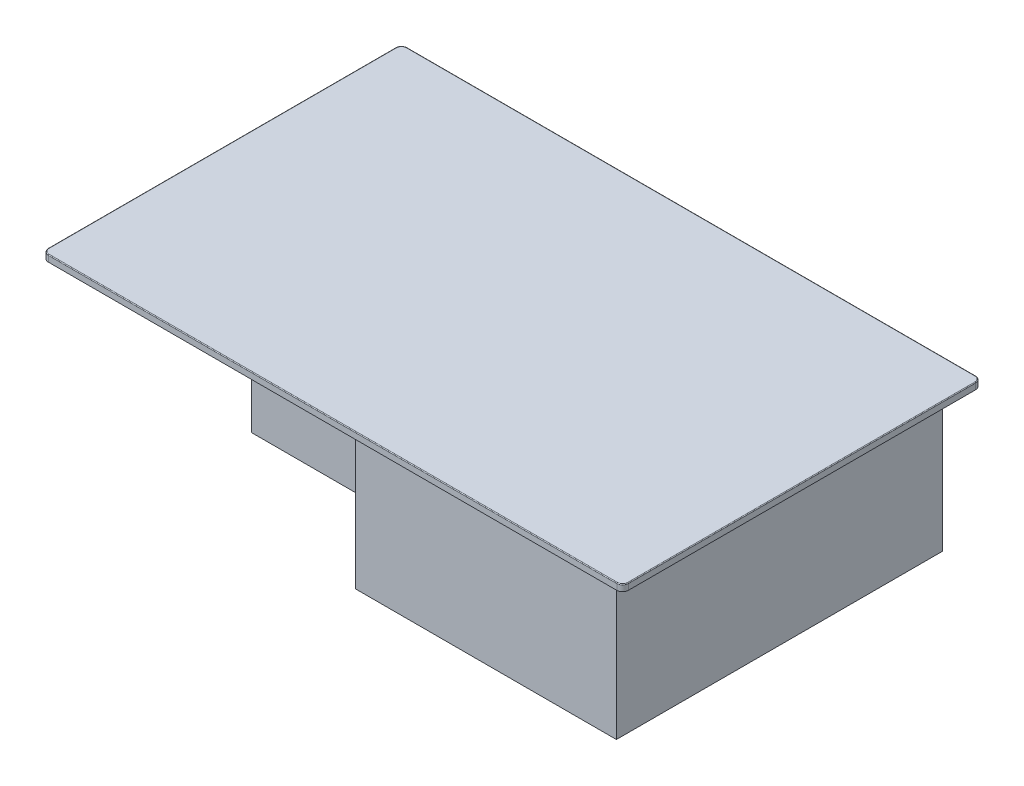
ISO-10303-21;
HEADER;
FILE_DESCRIPTION(('STEP AP214'),'2;1');
FILE_NAME('part.step','',(''),(''),'','','');
FILE_SCHEMA(('AUTOMOTIVE_DESIGN { 1 0 10303 214 1 1 1 1 }'));
ENDSEC;
DATA;
#1=APPLICATION_CONTEXT('core data for automotive mechanical design processes');
#2=APPLICATION_PROTOCOL_DEFINITION('international standard','automotive_design',2000,#1);
#3=PRODUCT_CONTEXT('',#1,'mechanical');
#4=PRODUCT('Part','Part','',(#3));
#5=PRODUCT_RELATED_PRODUCT_CATEGORY('part','',(#4));
#6=PRODUCT_DEFINITION_FORMATION('','',#4);
#7=PRODUCT_DEFINITION_CONTEXT('part definition',#1,'design');
#8=PRODUCT_DEFINITION('design','',#6,#7);
#9=PRODUCT_DEFINITION_SHAPE('','',#8);
#10=(LENGTH_UNIT() NAMED_UNIT(*) SI_UNIT(.MILLI.,.METRE.));
#11=(NAMED_UNIT(*) PLANE_ANGLE_UNIT() SI_UNIT($,.RADIAN.));
#12=(NAMED_UNIT(*) SI_UNIT($,.STERADIAN.) SOLID_ANGLE_UNIT());
#13=UNCERTAINTY_MEASURE_WITH_UNIT(LENGTH_MEASURE(1.E-05),#10,'distance_accuracy_value','');
#14=(GEOMETRIC_REPRESENTATION_CONTEXT(3) GLOBAL_UNCERTAINTY_ASSIGNED_CONTEXT((#13)) GLOBAL_UNIT_ASSIGNED_CONTEXT((#10,
#11,#12)) REPRESENTATION_CONTEXT('',''));
#15=CARTESIAN_POINT('',(0.,0.,0.));
#16=DIRECTION('',(0.,0.,1.));
#17=DIRECTION('',(1.,0.,0.));
#18=AXIS2_PLACEMENT_3D('',#15,#16,#17);
#19=CARTESIAN_POINT('',(0.,-9.,0.));
#20=DIRECTION('',(0.,1.,0.));
#21=DIRECTION('',(0.,0.,1.));
#22=AXIS2_PLACEMENT_3D('',#19,#20,#21);
#23=PLANE('',#22);
#24=DIRECTION('',(-1.,0.,0.));
#25=VECTOR('',#24,1.);
#26=CARTESIAN_POINT('',(400.,-9.,-247.5));
#27=LINE('',#26,#25);
#28=CARTESIAN_POINT('',(392.,-9.,-247.5));
#29=VERTEX_POINT('',#28);
#30=CARTESIAN_POINT('',(-392.,-9.,-247.5));
#31=VERTEX_POINT('',#30);
#32=EDGE_CURVE('E294',#29,#31,#27,.T.);
#33=ORIENTED_EDGE('',*,*,#32,.F.);
#34=CARTESIAN_POINT('',(392.,-9.,-239.5));
#35=DIRECTION('',(0.,1.,0.));
#36=DIRECTION('',(0.,0.,1.));
#37=AXIS2_PLACEMENT_3D('',#34,#35,#36);
#38=CIRCLE('',#37,8.);
#39=CARTESIAN_POINT('',(400.,-9.,-239.5));
#40=VERTEX_POINT('',#39);
#41=EDGE_CURVE('E313',#29,#40,#38,.F.);
#42=ORIENTED_EDGE('',*,*,#41,.T.);
#43=DIRECTION('',(0.,0.,-1.));
#44=VECTOR('',#43,1.);
#45=CARTESIAN_POINT('',(400.,-9.,247.5));
#46=LINE('',#45,#44);
#47=CARTESIAN_POINT('',(400.,-9.,239.5));
#48=VERTEX_POINT('',#47);
#49=EDGE_CURVE('E291',#48,#40,#46,.T.);
#50=ORIENTED_EDGE('',*,*,#49,.F.);
#51=CARTESIAN_POINT('',(392.,-9.,239.5));
#52=DIRECTION('',(0.,1.,0.));
#53=DIRECTION('',(0.,0.,1.));
#54=AXIS2_PLACEMENT_3D('',#51,#52,#53);
#55=CIRCLE('',#54,8.);
#56=CARTESIAN_POINT('',(392.,-9.,247.5));
#57=VERTEX_POINT('',#56);
#58=EDGE_CURVE('E307',#48,#57,#55,.F.);
#59=ORIENTED_EDGE('',*,*,#58,.T.);
#60=DIRECTION('',(1.,0.,0.));
#61=VECTOR('',#60,1.);
#62=CARTESIAN_POINT('',(400.,-9.,247.5));
#63=LINE('',#62,#61);
#64=CARTESIAN_POINT('',(-392.,-9.,247.5));
#65=VERTEX_POINT('',#64);
#66=EDGE_CURVE('E287',#65,#57,#63,.T.);
#67=ORIENTED_EDGE('',*,*,#66,.F.);
#68=CARTESIAN_POINT('',(-392.,-9.,239.5));
#69=DIRECTION('',(0.,1.,0.));
#70=DIRECTION('',(0.,0.,1.));
#71=AXIS2_PLACEMENT_3D('',#68,#69,#70);
#72=CIRCLE('',#71,8.);
#73=CARTESIAN_POINT('',(-400.,-9.,239.5));
#74=VERTEX_POINT('',#73);
#75=EDGE_CURVE('E309',#65,#74,#72,.F.);
#76=ORIENTED_EDGE('',*,*,#75,.T.);
#77=DIRECTION('',(0.,0.,1.));
#78=VECTOR('',#77,1.);
#79=CARTESIAN_POINT('',(-400.,-9.,247.5));
#80=LINE('',#79,#78);
#81=CARTESIAN_POINT('',(-400.,-9.,-239.5));
#82=VERTEX_POINT('',#81);
#83=EDGE_CURVE('E284',#82,#74,#80,.T.);
#84=ORIENTED_EDGE('',*,*,#83,.F.);
#85=CARTESIAN_POINT('',(-392.,-9.,-239.5));
#86=DIRECTION('',(0.,1.,0.));
#87=DIRECTION('',(0.,0.,1.));
#88=AXIS2_PLACEMENT_3D('',#85,#86,#87);
#89=CIRCLE('',#88,8.);
#90=EDGE_CURVE('E311',#82,#31,#89,.F.);
#91=ORIENTED_EDGE('',*,*,#90,.T.);
#92=EDGE_LOOP('',(#33,#42,#50,#59,#67,#76,#84,#91));
#93=FACE_BOUND('',#92,.T.);
#94=DIRECTION('',(0.,0.,-1.));
#95=VECTOR('',#94,1.);
#96=CARTESIAN_POINT('',(-387.5,-9.,-236.));
#97=LINE('',#96,#95);
#98=CARTESIAN_POINT('',(-387.5,-9.,236.));
#99=VERTEX_POINT('',#98);
#100=CARTESIAN_POINT('',(-387.5,-9.,-236.));
#101=VERTEX_POINT('',#100);
#102=EDGE_CURVE('E242',#99,#101,#97,.T.);
#103=ORIENTED_EDGE('',*,*,#102,.F.);
#104=DIRECTION('',(-1.,0.,0.));
#105=VECTOR('',#104,1.);
#106=CARTESIAN_POINT('',(387.5,-9.,236.));
#107=LINE('',#106,#105);
#108=CARTESIAN_POINT('',(387.5,-9.,236.));
#109=VERTEX_POINT('',#108);
#110=EDGE_CURVE('E255',#109,#99,#107,.T.);
#111=ORIENTED_EDGE('',*,*,#110,.F.);
#112=DIRECTION('',(0.,0.,1.));
#113=VECTOR('',#112,1.);
#114=CARTESIAN_POINT('',(387.5,-9.,-236.));
#115=LINE('',#114,#113);
#116=CARTESIAN_POINT('',(387.5,-9.,-236.));
#117=VERTEX_POINT('',#116);
#118=EDGE_CURVE('E267',#117,#109,#115,.T.);
#119=ORIENTED_EDGE('',*,*,#118,.F.);
#120=DIRECTION('',(1.,0.,0.));
#121=VECTOR('',#120,1.);
#122=CARTESIAN_POINT('',(387.5,-9.,-236.));
#123=LINE('',#122,#121);
#124=EDGE_CURVE('E264',#101,#117,#123,.T.);
#125=ORIENTED_EDGE('',*,*,#124,.F.);
#126=EDGE_LOOP('',(#103,#111,#119,#125));
#127=FACE_BOUND('',#126,.T.);
#128=ADVANCED_FACE('F35',(#93,#127),#23,.F.);
#129=CARTESIAN_POINT('',(-400.,-9.,247.5));
#130=DIRECTION('',(-1.,0.,0.));
#131=DIRECTION('',(0.,0.,1.));
#132=AXIS2_PLACEMENT_3D('',#129,#130,#131);
#133=PLANE('',#132);
#134=DIRECTION('',(0.,1.,0.));
#135=VECTOR('',#134,1.);
#136=CARTESIAN_POINT('',(-400.,-9.,239.5));
#137=LINE('',#136,#135);
#138=CARTESIAN_POINT('',(-400.,-0.999999999999999,239.5));
#139=VERTEX_POINT('',#138);
#140=EDGE_CURVE('E315',#74,#139,#137,.T.);
#141=ORIENTED_EDGE('',*,*,#140,.T.);
#142=DIRECTION('',(0.,0.,1.));
#143=VECTOR('',#142,1.);
#144=CARTESIAN_POINT('',(-400.,-0.999999999999999,247.5));
#145=LINE('',#144,#143);
#146=CARTESIAN_POINT('',(-400.,-0.999999999999999,-239.5));
#147=VERTEX_POINT('',#146);
#148=EDGE_CURVE('E349',#139,#147,#145,.F.);
#149=ORIENTED_EDGE('',*,*,#148,.T.);
#150=DIRECTION('',(0.,1.,0.));
#151=VECTOR('',#150,1.);
#152=CARTESIAN_POINT('',(-400.,-9.,-239.5));
#153=LINE('',#152,#151);
#154=EDGE_CURVE('E318',#147,#82,#153,.F.);
#155=ORIENTED_EDGE('',*,*,#154,.T.);
#156=ORIENTED_EDGE('',*,*,#83,.T.);
#157=EDGE_LOOP('',(#141,#149,#155,#156));
#158=FACE_BOUND('',#157,.T.);
#159=ADVANCED_FACE('F405',(#158),#133,.T.);
#160=CARTESIAN_POINT('',(400.,-9.,-247.5));
#161=DIRECTION('',(0.,0.,-1.));
#162=DIRECTION('',(-1.,0.,0.));
#163=AXIS2_PLACEMENT_3D('',#160,#161,#162);
#164=PLANE('',#163);
#165=DIRECTION('',(0.,1.,0.));
#166=VECTOR('',#165,1.);
#167=CARTESIAN_POINT('',(-392.,-9.,-247.5));
#168=LINE('',#167,#166);
#169=CARTESIAN_POINT('',(-392.,-0.999999999999999,-247.5));
#170=VERTEX_POINT('',#169);
#171=EDGE_CURVE('E302',#31,#170,#168,.T.);
#172=ORIENTED_EDGE('',*,*,#171,.T.);
#173=DIRECTION('',(-1.,0.,0.));
#174=VECTOR('',#173,1.);
#175=CARTESIAN_POINT('',(400.,-0.999999999999999,-247.5));
#176=LINE('',#175,#174);
#177=CARTESIAN_POINT('',(392.,-0.999999999999999,-247.5));
#178=VERTEX_POINT('',#177);
#179=EDGE_CURVE('E353',#170,#178,#176,.F.);
#180=ORIENTED_EDGE('',*,*,#179,.T.);
#181=DIRECTION('',(0.,1.,0.));
#182=VECTOR('',#181,1.);
#183=CARTESIAN_POINT('',(392.,-9.,-247.5));
#184=LINE('',#183,#182);
#185=EDGE_CURVE('E305',#178,#29,#184,.F.);
#186=ORIENTED_EDGE('',*,*,#185,.T.);
#187=ORIENTED_EDGE('',*,*,#32,.T.);
#188=EDGE_LOOP('',(#172,#180,#186,#187));
#189=FACE_BOUND('',#188,.T.);
#190=ADVANCED_FACE('F411',(#189),#164,.T.);
#191=CARTESIAN_POINT('',(400.,-9.,247.5));
#192=DIRECTION('',(1.,0.,0.));
#193=DIRECTION('',(0.,0.,-1.));
#194=AXIS2_PLACEMENT_3D('',#191,#192,#193);
#195=PLANE('',#194);
#196=DIRECTION('',(0.,1.,0.));
#197=VECTOR('',#196,1.);
#198=CARTESIAN_POINT('',(400.,-9.,-239.5));
#199=LINE('',#198,#197);
#200=CARTESIAN_POINT('',(400.,-0.999999999999999,-239.5));
#201=VERTEX_POINT('',#200);
#202=EDGE_CURVE('E299',#40,#201,#199,.T.);
#203=ORIENTED_EDGE('',*,*,#202,.T.);
#204=DIRECTION('',(0.,0.,-1.));
#205=VECTOR('',#204,1.);
#206=CARTESIAN_POINT('',(400.,-0.999999999999999,247.5));
#207=LINE('',#206,#205);
#208=CARTESIAN_POINT('',(400.,-0.999999999999999,239.5));
#209=VERTEX_POINT('',#208);
#210=EDGE_CURVE('E357',#201,#209,#207,.F.);
#211=ORIENTED_EDGE('',*,*,#210,.T.);
#212=DIRECTION('',(0.,1.,0.));
#213=VECTOR('',#212,1.);
#214=CARTESIAN_POINT('',(400.,-9.,239.5));
#215=LINE('',#214,#213);
#216=EDGE_CURVE('E297',#209,#48,#215,.F.);
#217=ORIENTED_EDGE('',*,*,#216,.T.);
#218=ORIENTED_EDGE('',*,*,#49,.T.);
#219=EDGE_LOOP('',(#203,#211,#217,#218));
#220=FACE_BOUND('',#219,.T.);
#221=ADVANCED_FACE('F428',(#220),#195,.T.);
#222=CARTESIAN_POINT('',(400.,-9.,247.5));
#223=DIRECTION('',(0.,0.,1.));
#224=DIRECTION('',(1.,0.,0.));
#225=AXIS2_PLACEMENT_3D('',#222,#223,#224);
#226=PLANE('',#225);
#227=DIRECTION('',(0.,1.,0.));
#228=VECTOR('',#227,1.);
#229=CARTESIAN_POINT('',(392.,-9.,247.5));
#230=LINE('',#229,#228);
#231=CARTESIAN_POINT('',(392.,-0.999999999999999,247.5));
#232=VERTEX_POINT('',#231);
#233=EDGE_CURVE('E320',#57,#232,#230,.T.);
#234=ORIENTED_EDGE('',*,*,#233,.T.);
#235=DIRECTION('',(1.,0.,0.));
#236=VECTOR('',#235,1.);
#237=CARTESIAN_POINT('',(400.,-0.999999999999999,247.5));
#238=LINE('',#237,#236);
#239=CARTESIAN_POINT('',(-392.,-0.999999999999999,247.5));
#240=VERTEX_POINT('',#239);
#241=EDGE_CURVE('E345',#232,#240,#238,.F.);
#242=ORIENTED_EDGE('',*,*,#241,.T.);
#243=DIRECTION('',(0.,1.,0.));
#244=VECTOR('',#243,1.);
#245=CARTESIAN_POINT('',(-392.,-9.,247.5));
#246=LINE('',#245,#244);
#247=EDGE_CURVE('E323',#240,#65,#246,.F.);
#248=ORIENTED_EDGE('',*,*,#247,.T.);
#249=ORIENTED_EDGE('',*,*,#66,.T.);
#250=EDGE_LOOP('',(#234,#242,#248,#249));
#251=FACE_BOUND('',#250,.T.);
#252=ADVANCED_FACE('F424',(#251),#226,.T.);
#253=CARTESIAN_POINT('',(0.,0.,0.));
#254=DIRECTION('',(0.,1.,0.));
#255=DIRECTION('',(0.,0.,1.));
#256=AXIS2_PLACEMENT_3D('',#253,#254,#255);
#257=PLANE('',#256);
#258=DIRECTION('',(1.,0.,0.));
#259=VECTOR('',#258,1.);
#260=CARTESIAN_POINT('',(0.,0.,246.5));
#261=LINE('',#260,#259);
#262=CARTESIAN_POINT('',(-392.,0.,246.5));
#263=VERTEX_POINT('',#262);
#264=CARTESIAN_POINT('',(392.,0.,246.5));
#265=VERTEX_POINT('',#264);
#266=EDGE_CURVE('E337',#263,#265,#261,.T.);
#267=ORIENTED_EDGE('',*,*,#266,.T.);
#268=CARTESIAN_POINT('',(392.,0.,239.5));
#269=DIRECTION('',(0.,1.,0.));
#270=DIRECTION('',(0.,0.,1.));
#271=AXIS2_PLACEMENT_3D('',#268,#269,#270);
#272=CIRCLE('',#271,7.);
#273=CARTESIAN_POINT('',(399.,0.,239.5));
#274=VERTEX_POINT('',#273);
#275=EDGE_CURVE('E339',#265,#274,#272,.T.);
#276=ORIENTED_EDGE('',*,*,#275,.T.);
#277=DIRECTION('',(0.,0.,-1.));
#278=VECTOR('',#277,1.);
#279=CARTESIAN_POINT('',(399.,0.,0.));
#280=LINE('',#279,#278);
#281=CARTESIAN_POINT('',(399.,0.,-239.5));
#282=VERTEX_POINT('',#281);
#283=EDGE_CURVE('E325',#274,#282,#280,.T.);
#284=ORIENTED_EDGE('',*,*,#283,.T.);
#285=CARTESIAN_POINT('',(392.,0.,-239.5));
#286=DIRECTION('',(0.,1.,0.));
#287=DIRECTION('',(0.,0.,1.));
#288=AXIS2_PLACEMENT_3D('',#285,#286,#287);
#289=CIRCLE('',#288,7.);
#290=CARTESIAN_POINT('',(392.,0.,-246.5));
#291=VERTEX_POINT('',#290);
#292=EDGE_CURVE('E327',#282,#291,#289,.T.);
#293=ORIENTED_EDGE('',*,*,#292,.T.);
#294=DIRECTION('',(-1.,0.,0.));
#295=VECTOR('',#294,1.);
#296=CARTESIAN_POINT('',(0.,0.,-246.5));
#297=LINE('',#296,#295);
#298=CARTESIAN_POINT('',(-392.,0.,-246.5));
#299=VERTEX_POINT('',#298);
#300=EDGE_CURVE('E329',#291,#299,#297,.T.);
#301=ORIENTED_EDGE('',*,*,#300,.T.);
#302=CARTESIAN_POINT('',(-392.,0.,-239.5));
#303=DIRECTION('',(0.,1.,0.));
#304=DIRECTION('',(0.,0.,1.));
#305=AXIS2_PLACEMENT_3D('',#302,#303,#304);
#306=CIRCLE('',#305,7.);
#307=CARTESIAN_POINT('',(-399.,0.,-239.5));
#308=VERTEX_POINT('',#307);
#309=EDGE_CURVE('E331',#299,#308,#306,.T.);
#310=ORIENTED_EDGE('',*,*,#309,.T.);
#311=DIRECTION('',(0.,0.,1.));
#312=VECTOR('',#311,1.);
#313=CARTESIAN_POINT('',(-399.,0.,0.));
#314=LINE('',#313,#312);
#315=CARTESIAN_POINT('',(-399.,0.,239.5));
#316=VERTEX_POINT('',#315);
#317=EDGE_CURVE('E333',#308,#316,#314,.T.);
#318=ORIENTED_EDGE('',*,*,#317,.T.);
#319=CARTESIAN_POINT('',(-392.,0.,239.5));
#320=DIRECTION('',(0.,1.,0.));
#321=DIRECTION('',(0.,0.,1.));
#322=AXIS2_PLACEMENT_3D('',#319,#320,#321);
#323=CIRCLE('',#322,7.);
#324=EDGE_CURVE('E335',#316,#263,#323,.T.);
#325=ORIENTED_EDGE('',*,*,#324,.T.);
#326=EDGE_LOOP('',(#267,#276,#284,#293,#301,#310,#318,#325));
#327=FACE_BOUND('',#326,.T.);
#328=ADVANCED_FACE('F420',(#327),#257,.T.);
#329=CARTESIAN_POINT('',(392.,-9.,-239.5));
#330=DIRECTION('',(0.,1.,0.));
#331=DIRECTION('',(0.,0.,1.));
#332=AXIS2_PLACEMENT_3D('',#329,#330,#331);
#333=CYLINDRICAL_SURFACE('',#332,8.);
#334=ORIENTED_EDGE('',*,*,#185,.F.);
#335=CARTESIAN_POINT('',(392.,-0.999999999999999,-239.5));
#336=DIRECTION('',(0.,1.,0.));
#337=DIRECTION('',(0.,0.,1.));
#338=AXIS2_PLACEMENT_3D('',#335,#336,#337);
#339=CIRCLE('',#338,8.);
#340=EDGE_CURVE('E355',#178,#201,#339,.F.);
#341=ORIENTED_EDGE('',*,*,#340,.T.);
#342=ORIENTED_EDGE('',*,*,#202,.F.);
#343=ORIENTED_EDGE('',*,*,#41,.F.);
#344=EDGE_LOOP('',(#334,#341,#342,#343));
#345=FACE_BOUND('',#344,.T.);
#346=ADVANCED_FACE('F423',(#345),#333,.T.);
#347=CARTESIAN_POINT('',(-392.,-9.,-239.5));
#348=DIRECTION('',(0.,1.,0.));
#349=DIRECTION('',(0.,0.,1.));
#350=AXIS2_PLACEMENT_3D('',#347,#348,#349);
#351=CYLINDRICAL_SURFACE('',#350,8.);
#352=ORIENTED_EDGE('',*,*,#154,.F.);
#353=CARTESIAN_POINT('',(-392.,-0.999999999999999,-239.5));
#354=DIRECTION('',(0.,1.,0.));
#355=DIRECTION('',(0.,0.,1.));
#356=AXIS2_PLACEMENT_3D('',#353,#354,#355);
#357=CIRCLE('',#356,8.);
#358=EDGE_CURVE('E351',#147,#170,#357,.F.);
#359=ORIENTED_EDGE('',*,*,#358,.T.);
#360=ORIENTED_EDGE('',*,*,#171,.F.);
#361=ORIENTED_EDGE('',*,*,#90,.F.);
#362=EDGE_LOOP('',(#352,#359,#360,#361));
#363=FACE_BOUND('',#362,.T.);
#364=ADVANCED_FACE('F438',(#363),#351,.T.);
#365=CARTESIAN_POINT('',(-392.,-9.,239.5));
#366=DIRECTION('',(0.,1.,0.));
#367=DIRECTION('',(0.,0.,1.));
#368=AXIS2_PLACEMENT_3D('',#365,#366,#367);
#369=CYLINDRICAL_SURFACE('',#368,8.);
#370=ORIENTED_EDGE('',*,*,#247,.F.);
#371=CARTESIAN_POINT('',(-392.,-0.999999999999999,239.5));
#372=DIRECTION('',(0.,1.,0.));
#373=DIRECTION('',(0.,0.,1.));
#374=AXIS2_PLACEMENT_3D('',#371,#372,#373);
#375=CIRCLE('',#374,8.);
#376=EDGE_CURVE('E347',#240,#139,#375,.F.);
#377=ORIENTED_EDGE('',*,*,#376,.T.);
#378=ORIENTED_EDGE('',*,*,#140,.F.);
#379=ORIENTED_EDGE('',*,*,#75,.F.);
#380=EDGE_LOOP('',(#370,#377,#378,#379));
#381=FACE_BOUND('',#380,.T.);
#382=ADVANCED_FACE('F442',(#381),#369,.T.);
#383=CARTESIAN_POINT('',(392.,-9.,239.5));
#384=DIRECTION('',(0.,1.,0.));
#385=DIRECTION('',(0.,0.,1.));
#386=AXIS2_PLACEMENT_3D('',#383,#384,#385);
#387=CYLINDRICAL_SURFACE('',#386,8.);
#388=ORIENTED_EDGE('',*,*,#216,.F.);
#389=CARTESIAN_POINT('',(392.,-0.999999999999999,239.5));
#390=DIRECTION('',(0.,1.,0.));
#391=DIRECTION('',(0.,0.,1.));
#392=AXIS2_PLACEMENT_3D('',#389,#390,#391);
#393=CIRCLE('',#392,8.);
#394=EDGE_CURVE('E342',#209,#232,#393,.F.);
#395=ORIENTED_EDGE('',*,*,#394,.T.);
#396=ORIENTED_EDGE('',*,*,#233,.F.);
#397=ORIENTED_EDGE('',*,*,#58,.F.);
#398=EDGE_LOOP('',(#388,#395,#396,#397));
#399=FACE_BOUND('',#398,.T.);
#400=ADVANCED_FACE('F446',(#399),#387,.T.);
#401=CARTESIAN_POINT('',(-392.,-0.999999999999999,-239.5));
#402=DIRECTION('',(0.,1.,0.));
#403=DIRECTION('',(0.,0.,1.));
#404=AXIS2_PLACEMENT_3D('',#401,#402,#403);
#405=TOROIDAL_SURFACE('',#404,7.,1.);
#406=CARTESIAN_POINT('',(-392.,-0.999999999999999,-246.5));
#407=DIRECTION('',(1.,0.,0.));
#408=DIRECTION('',(0.,0.,-1.));
#409=AXIS2_PLACEMENT_3D('',#406,#407,#408);
#410=CIRCLE('',#409,1.);
#411=EDGE_CURVE('E375',#170,#299,#410,.T.);
#412=ORIENTED_EDGE('',*,*,#411,.F.);
#413=ORIENTED_EDGE('',*,*,#358,.F.);
#414=CARTESIAN_POINT('',(-399.,-1.,-239.5));
#415=DIRECTION('',(0.,0.,1.));
#416=DIRECTION('',(1.,0.,0.));
#417=AXIS2_PLACEMENT_3D('',#414,#415,#416);
#418=CIRCLE('',#417,1.);
#419=EDGE_CURVE('E288',#308,#147,#418,.T.);
#420=ORIENTED_EDGE('',*,*,#419,.F.);
#421=ORIENTED_EDGE('',*,*,#309,.F.);
#422=EDGE_LOOP('',(#412,#413,#420,#421));
#423=FACE_BOUND('',#422,.T.);
#424=ADVANCED_FACE('F37',(#423),#405,.T.);
#425=CARTESIAN_POINT('',(-399.,-1.,0.));
#426=DIRECTION('',(0.,0.,1.));
#427=DIRECTION('',(1.,0.,0.));
#428=AXIS2_PLACEMENT_3D('',#425,#426,#427);
#429=CYLINDRICAL_SURFACE('',#428,1.);
#430=ORIENTED_EDGE('',*,*,#419,.T.);
#431=ORIENTED_EDGE('',*,*,#148,.F.);
#432=CARTESIAN_POINT('',(-399.,-1.,239.5));
#433=DIRECTION('',(0.,0.,1.));
#434=DIRECTION('',(1.,0.,0.));
#435=AXIS2_PLACEMENT_3D('',#432,#433,#434);
#436=CIRCLE('',#435,1.);
#437=EDGE_CURVE('E372',#316,#139,#436,.T.);
#438=ORIENTED_EDGE('',*,*,#437,.F.);
#439=ORIENTED_EDGE('',*,*,#317,.F.);
#440=EDGE_LOOP('',(#430,#431,#438,#439));
#441=FACE_BOUND('',#440,.T.);
#442=ADVANCED_FACE('F473',(#441),#429,.T.);
#443=CARTESIAN_POINT('',(0.,-1.,-246.5));
#444=DIRECTION('',(-1.,0.,0.));
#445=DIRECTION('',(0.,0.,1.));
#446=AXIS2_PLACEMENT_3D('',#443,#444,#445);
#447=CYLINDRICAL_SURFACE('',#446,1.);
#448=ORIENTED_EDGE('',*,*,#411,.T.);
#449=ORIENTED_EDGE('',*,*,#300,.F.);
#450=CARTESIAN_POINT('',(392.,-1.,-246.5));
#451=DIRECTION('',(1.,0.,0.));
#452=DIRECTION('',(0.,0.,-1.));
#453=AXIS2_PLACEMENT_3D('',#450,#451,#452);
#454=CIRCLE('',#453,1.);
#455=EDGE_CURVE('E369',#178,#291,#454,.T.);
#456=ORIENTED_EDGE('',*,*,#455,.F.);
#457=ORIENTED_EDGE('',*,*,#179,.F.);
#458=EDGE_LOOP('',(#448,#449,#456,#457));
#459=FACE_BOUND('',#458,.T.);
#460=ADVANCED_FACE('F470',(#459),#447,.T.);
#461=CARTESIAN_POINT('',(-392.,-0.999999999999999,239.5));
#462=DIRECTION('',(0.,1.,0.));
#463=DIRECTION('',(0.,0.,1.));
#464=AXIS2_PLACEMENT_3D('',#461,#462,#463);
#465=TOROIDAL_SURFACE('',#464,7.,1.);
#466=ORIENTED_EDGE('',*,*,#437,.T.);
#467=ORIENTED_EDGE('',*,*,#376,.F.);
#468=CARTESIAN_POINT('',(-392.,-1.,246.5));
#469=DIRECTION('',(1.,0.,0.));
#470=DIRECTION('',(0.,0.,-1.));
#471=AXIS2_PLACEMENT_3D('',#468,#469,#470);
#472=CIRCLE('',#471,1.);
#473=EDGE_CURVE('E366',#263,#240,#472,.T.);
#474=ORIENTED_EDGE('',*,*,#473,.F.);
#475=ORIENTED_EDGE('',*,*,#324,.F.);
#476=EDGE_LOOP('',(#466,#467,#474,#475));
#477=FACE_BOUND('',#476,.T.);
#478=ADVANCED_FACE('F466',(#477),#465,.T.);
#479=CARTESIAN_POINT('',(392.,-0.999999999999999,-239.5));
#480=DIRECTION('',(0.,1.,0.));
#481=DIRECTION('',(0.,0.,1.));
#482=AXIS2_PLACEMENT_3D('',#479,#480,#481);
#483=TOROIDAL_SURFACE('',#482,7.,1.);
#484=ORIENTED_EDGE('',*,*,#455,.T.);
#485=ORIENTED_EDGE('',*,*,#292,.F.);
#486=CARTESIAN_POINT('',(399.,-0.999999999999999,-239.5));
#487=DIRECTION('',(0.,0.,1.));
#488=DIRECTION('',(1.,0.,0.));
#489=AXIS2_PLACEMENT_3D('',#486,#487,#488);
#490=CIRCLE('',#489,1.);
#491=EDGE_CURVE('E363',#201,#282,#490,.T.);
#492=ORIENTED_EDGE('',*,*,#491,.F.);
#493=ORIENTED_EDGE('',*,*,#340,.F.);
#494=EDGE_LOOP('',(#484,#485,#492,#493));
#495=FACE_BOUND('',#494,.T.);
#496=ADVANCED_FACE('F462',(#495),#483,.T.);
#497=CARTESIAN_POINT('',(0.,-1.,246.5));
#498=DIRECTION('',(1.,0.,0.));
#499=DIRECTION('',(0.,0.,-1.));
#500=AXIS2_PLACEMENT_3D('',#497,#498,#499);
#501=CYLINDRICAL_SURFACE('',#500,1.);
#502=ORIENTED_EDGE('',*,*,#473,.T.);
#503=ORIENTED_EDGE('',*,*,#241,.F.);
#504=CARTESIAN_POINT('',(392.,-1.,246.5));
#505=DIRECTION('',(1.,0.,0.));
#506=DIRECTION('',(0.,0.,-1.));
#507=AXIS2_PLACEMENT_3D('',#504,#505,#506);
#508=CIRCLE('',#507,1.);
#509=EDGE_CURVE('E361',#265,#232,#508,.T.);
#510=ORIENTED_EDGE('',*,*,#509,.F.);
#511=ORIENTED_EDGE('',*,*,#266,.F.);
#512=EDGE_LOOP('',(#502,#503,#510,#511));
#513=FACE_BOUND('',#512,.T.);
#514=ADVANCED_FACE('F458',(#513),#501,.T.);
#515=CARTESIAN_POINT('',(399.,-1.,0.));
#516=DIRECTION('',(0.,0.,-1.));
#517=DIRECTION('',(-1.,0.,0.));
#518=AXIS2_PLACEMENT_3D('',#515,#516,#517);
#519=CYLINDRICAL_SURFACE('',#518,1.);
#520=ORIENTED_EDGE('',*,*,#491,.T.);
#521=ORIENTED_EDGE('',*,*,#283,.F.);
#522=CARTESIAN_POINT('',(399.,-1.,239.5));
#523=DIRECTION('',(0.,0.,1.));
#524=DIRECTION('',(1.,0.,0.));
#525=AXIS2_PLACEMENT_3D('',#522,#523,#524);
#526=CIRCLE('',#525,1.);
#527=EDGE_CURVE('E283',#209,#274,#526,.T.);
#528=ORIENTED_EDGE('',*,*,#527,.F.);
#529=ORIENTED_EDGE('',*,*,#210,.F.);
#530=EDGE_LOOP('',(#520,#521,#528,#529));
#531=FACE_BOUND('',#530,.T.);
#532=ADVANCED_FACE('F454',(#531),#519,.T.);
#533=CARTESIAN_POINT('',(392.,-0.999999999999999,239.5));
#534=DIRECTION('',(0.,1.,0.));
#535=DIRECTION('',(0.,0.,1.));
#536=AXIS2_PLACEMENT_3D('',#533,#534,#535);
#537=TOROIDAL_SURFACE('',#536,7.,1.);
#538=ORIENTED_EDGE('',*,*,#509,.T.);
#539=ORIENTED_EDGE('',*,*,#394,.F.);
#540=ORIENTED_EDGE('',*,*,#527,.T.);
#541=ORIENTED_EDGE('',*,*,#275,.F.);
#542=EDGE_LOOP('',(#538,#539,#540,#541));
#543=FACE_BOUND('',#542,.T.);
#544=ADVANCED_FACE('F451',(#543),#537,.T.);
#545=CARTESIAN_POINT('',(-387.5,-13.,-236.));
#546=DIRECTION('',(1.,0.,0.));
#547=DIRECTION('',(0.,0.,-1.));
#548=AXIS2_PLACEMENT_3D('',#545,#546,#547);
#549=PLANE('',#548);
#550=ORIENTED_EDGE('',*,*,#102,.T.);
#551=DIRECTION('',(0.,1.,0.));
#552=VECTOR('',#551,1.);
#553=CARTESIAN_POINT('',(-387.5,-13.,-236.));
#554=LINE('',#553,#552);
#555=CARTESIAN_POINT('',(-387.5,-13.,-236.));
#556=VERTEX_POINT('',#555);
#557=EDGE_CURVE('E280',#556,#101,#554,.T.);
#558=ORIENTED_EDGE('',*,*,#557,.F.);
#559=DIRECTION('',(0.,0.,-1.));
#560=VECTOR('',#559,1.);
#561=CARTESIAN_POINT('',(-387.5,-13.,-236.));
#562=LINE('',#561,#560);
#563=CARTESIAN_POINT('',(-387.5,-13.,236.));
#564=VERTEX_POINT('',#563);
#565=EDGE_CURVE('E251',#564,#556,#562,.T.);
#566=ORIENTED_EDGE('',*,*,#565,.F.);
#567=DIRECTION('',(0.,1.,0.));
#568=VECTOR('',#567,1.);
#569=CARTESIAN_POINT('',(-387.5,-13.,236.));
#570=LINE('',#569,#568);
#571=EDGE_CURVE('E261',#564,#99,#570,.T.);
#572=ORIENTED_EDGE('',*,*,#571,.T.);
#573=EDGE_LOOP('',(#550,#558,#566,#572));
#574=FACE_BOUND('',#573,.T.);
#575=ADVANCED_FACE('F418',(#574),#549,.F.);
#576=CARTESIAN_POINT('',(387.5,-13.,-236.));
#577=DIRECTION('',(0.,0.,1.));
#578=DIRECTION('',(1.,0.,0.));
#579=AXIS2_PLACEMENT_3D('',#576,#577,#578);
#580=PLANE('',#579);
#581=ORIENTED_EDGE('',*,*,#124,.T.);
#582=DIRECTION('',(0.,1.,0.));
#583=VECTOR('',#582,1.);
#584=CARTESIAN_POINT('',(387.5,-13.,-236.));
#585=LINE('',#584,#583);
#586=CARTESIAN_POINT('',(387.5,-13.,-236.));
#587=VERTEX_POINT('',#586);
#588=EDGE_CURVE('E277',#587,#117,#585,.T.);
#589=ORIENTED_EDGE('',*,*,#588,.F.);
#590=DIRECTION('',(1.,0.,0.));
#591=VECTOR('',#590,1.);
#592=CARTESIAN_POINT('',(387.5,-13.,-236.));
#593=LINE('',#592,#591);
#594=EDGE_CURVE('E254',#556,#587,#593,.T.);
#595=ORIENTED_EDGE('',*,*,#594,.F.);
#596=ORIENTED_EDGE('',*,*,#557,.T.);
#597=EDGE_LOOP('',(#581,#589,#595,#596));
#598=FACE_BOUND('',#597,.T.);
#599=ADVANCED_FACE('F626',(#598),#580,.F.);
#600=CARTESIAN_POINT('',(387.5,-13.,-236.));
#601=DIRECTION('',(-1.,0.,0.));
#602=DIRECTION('',(0.,0.,1.));
#603=AXIS2_PLACEMENT_3D('',#600,#601,#602);
#604=PLANE('',#603);
#605=ORIENTED_EDGE('',*,*,#118,.T.);
#606=DIRECTION('',(0.,1.,0.));
#607=VECTOR('',#606,1.);
#608=CARTESIAN_POINT('',(387.5,-13.,236.));
#609=LINE('',#608,#607);
#610=CARTESIAN_POINT('',(387.5,-13.,236.));
#611=VERTEX_POINT('',#610);
#612=EDGE_CURVE('E274',#611,#109,#609,.T.);
#613=ORIENTED_EDGE('',*,*,#612,.F.);
#614=DIRECTION('',(0.,0.,1.));
#615=VECTOR('',#614,1.);
#616=CARTESIAN_POINT('',(387.5,-13.,-236.));
#617=LINE('',#616,#615);
#618=EDGE_CURVE('E257',#587,#611,#617,.T.);
#619=ORIENTED_EDGE('',*,*,#618,.F.);
#620=ORIENTED_EDGE('',*,*,#588,.T.);
#621=EDGE_LOOP('',(#605,#613,#619,#620));
#622=FACE_BOUND('',#621,.T.);
#623=ADVANCED_FACE('F634',(#622),#604,.F.);
#624=CARTESIAN_POINT('',(387.5,-13.,236.));
#625=DIRECTION('',(0.,0.,-1.));
#626=DIRECTION('',(-1.,0.,0.));
#627=AXIS2_PLACEMENT_3D('',#624,#625,#626);
#628=PLANE('',#627);
#629=ORIENTED_EDGE('',*,*,#110,.T.);
#630=ORIENTED_EDGE('',*,*,#571,.F.);
#631=DIRECTION('',(-1.,0.,0.));
#632=VECTOR('',#631,1.);
#633=CARTESIAN_POINT('',(387.5,-13.,236.));
#634=LINE('',#633,#632);
#635=EDGE_CURVE('E259',#611,#564,#634,.T.);
#636=ORIENTED_EDGE('',*,*,#635,.F.);
#637=ORIENTED_EDGE('',*,*,#612,.T.);
#638=EDGE_LOOP('',(#629,#630,#636,#637));
#639=FACE_BOUND('',#638,.T.);
#640=ADVANCED_FACE('F642',(#639),#628,.F.);
#641=CARTESIAN_POINT('',(0.,-13.,0.));
#642=DIRECTION('',(0.,-1.,0.));
#643=DIRECTION('',(0.,0.,-1.));
#644=AXIS2_PLACEMENT_3D('',#641,#642,#643);
#645=PLANE('',#644);
#646=DIRECTION('',(0.,0.,-1.));
#647=VECTOR('',#646,1.);
#648=CARTESIAN_POINT('',(9.00000000000001,-13.,0.));
#649=LINE('',#648,#647);
#650=CARTESIAN_POINT('',(9.00000000000001,-13.,225.));
#651=VERTEX_POINT('',#650);
#652=CARTESIAN_POINT('',(9.00000000000001,-13.,-225.));
#653=VERTEX_POINT('',#652);
#654=EDGE_CURVE('E11',#651,#653,#649,.T.);
#655=ORIENTED_EDGE('',*,*,#654,.F.);
#656=DIRECTION('',(-1.,0.,0.));
#657=VECTOR('',#656,1.);
#658=CARTESIAN_POINT('',(0.,-13.,225.));
#659=LINE('',#658,#657);
#660=CARTESIAN_POINT('',(369.,-13.,225.));
#661=VERTEX_POINT('',#660);
#662=EDGE_CURVE('E198',#661,#651,#659,.T.);
#663=ORIENTED_EDGE('',*,*,#662,.F.);
#664=DIRECTION('',(0.,0.,1.));
#665=VECTOR('',#664,1.);
#666=CARTESIAN_POINT('',(369.,-13.,0.));
#667=LINE('',#666,#665);
#668=CARTESIAN_POINT('',(369.,-13.,-225.));
#669=VERTEX_POINT('',#668);
#670=EDGE_CURVE('E53',#669,#661,#667,.T.);
#671=ORIENTED_EDGE('',*,*,#670,.F.);
#672=DIRECTION('',(1.,0.,0.));
#673=VECTOR('',#672,1.);
#674=CARTESIAN_POINT('',(0.,-13.,-225.));
#675=LINE('',#674,#673);
#676=EDGE_CURVE('E43',#653,#669,#675,.T.);
#677=ORIENTED_EDGE('',*,*,#676,.F.);
#678=EDGE_LOOP('',(#655,#663,#671,#677));
#679=FACE_BOUND('',#678,.T.);
#680=DIRECTION('',(0.,0.,-1.));
#681=VECTOR('',#680,1.);
#682=CARTESIAN_POINT('',(-169.,-13.,0.));
#683=LINE('',#682,#681);
#684=CARTESIAN_POINT('',(-169.,-13.,190.));
#685=VERTEX_POINT('',#684);
#686=CARTESIAN_POINT('',(-169.,-13.,-190.));
#687=VERTEX_POINT('',#686);
#688=EDGE_CURVE('E388',#685,#687,#683,.T.);
#689=ORIENTED_EDGE('',*,*,#688,.F.);
#690=DIRECTION('',(-1.,0.,0.));
#691=VECTOR('',#690,1.);
#692=CARTESIAN_POINT('',(0.,-13.,190.));
#693=LINE('',#692,#691);
#694=CARTESIAN_POINT('',(1.00000000000001,-13.,190.));
#695=VERTEX_POINT('',#694);
#696=EDGE_CURVE('E359',#695,#685,#693,.T.);
#697=ORIENTED_EDGE('',*,*,#696,.F.);
#698=DIRECTION('',(0.,0.,1.));
#699=VECTOR('',#698,1.);
#700=CARTESIAN_POINT('',(1.,-13.,0.));
#701=LINE('',#700,#699);
#702=CARTESIAN_POINT('',(1.,-13.,-190.));
#703=VERTEX_POINT('',#702);
#704=EDGE_CURVE('E382',#703,#695,#701,.T.);
#705=ORIENTED_EDGE('',*,*,#704,.F.);
#706=DIRECTION('',(1.,0.,0.));
#707=VECTOR('',#706,1.);
#708=CARTESIAN_POINT('',(0.,-13.,-190.));
#709=LINE('',#708,#707);
#710=EDGE_CURVE('E385',#687,#703,#709,.T.);
#711=ORIENTED_EDGE('',*,*,#710,.F.);
#712=EDGE_LOOP('',(#689,#697,#705,#711));
#713=FACE_BOUND('',#712,.T.);
#714=ORIENTED_EDGE('',*,*,#565,.T.);
#715=ORIENTED_EDGE('',*,*,#594,.T.);
#716=ORIENTED_EDGE('',*,*,#618,.T.);
#717=ORIENTED_EDGE('',*,*,#635,.T.);
#718=EDGE_LOOP('',(#714,#715,#716,#717));
#719=FACE_BOUND('',#718,.T.);
#720=ADVANCED_FACE('F651',(#679,#713,#719),#645,.T.);
#721=CARTESIAN_POINT('',(-169.,-130.,190.));
#722=DIRECTION('',(-1.,0.,0.));
#723=DIRECTION('',(0.,0.,1.));
#724=AXIS2_PLACEMENT_3D('',#721,#722,#723);
#725=PLANE('',#724);
#726=DIRECTION('',(0.,1.,0.));
#727=VECTOR('',#726,1.);
#728=CARTESIAN_POINT('',(-169.,-130.,190.));
#729=LINE('',#728,#727);
#730=CARTESIAN_POINT('',(-169.,-130.,190.));
#731=VERTEX_POINT('',#730);
#732=EDGE_CURVE('E238',#731,#685,#729,.T.);
#733=ORIENTED_EDGE('',*,*,#732,.T.);
#734=ORIENTED_EDGE('',*,*,#688,.T.);
#735=DIRECTION('',(0.,1.,0.));
#736=VECTOR('',#735,1.);
#737=CARTESIAN_POINT('',(-169.,-130.,-190.));
#738=LINE('',#737,#736);
#739=CARTESIAN_POINT('',(-169.,-130.,-190.));
#740=VERTEX_POINT('',#739);
#741=EDGE_CURVE('E239',#740,#687,#738,.T.);
#742=ORIENTED_EDGE('',*,*,#741,.F.);
#743=DIRECTION('',(0.,0.,1.));
#744=VECTOR('',#743,1.);
#745=CARTESIAN_POINT('',(-169.,-130.,190.));
#746=LINE('',#745,#744);
#747=EDGE_CURVE('E222',#740,#731,#746,.T.);
#748=ORIENTED_EDGE('',*,*,#747,.T.);
#749=EDGE_LOOP('',(#733,#734,#742,#748));
#750=FACE_BOUND('',#749,.T.);
#751=ADVANCED_FACE('F660',(#750),#725,.T.);
#752=CARTESIAN_POINT('',(1.,-130.,-190.));
#753=DIRECTION('',(0.,0.,-1.));
#754=DIRECTION('',(-1.,0.,0.));
#755=AXIS2_PLACEMENT_3D('',#752,#753,#754);
#756=PLANE('',#755);
#757=ORIENTED_EDGE('',*,*,#741,.T.);
#758=ORIENTED_EDGE('',*,*,#710,.T.);
#759=DIRECTION('',(0.,1.,0.));
#760=VECTOR('',#759,1.);
#761=CARTESIAN_POINT('',(1.,-130.,-190.));
#762=LINE('',#761,#760);
#763=CARTESIAN_POINT('',(1.,-130.,-190.));
#764=VERTEX_POINT('',#763);
#765=EDGE_CURVE('E243',#764,#703,#762,.T.);
#766=ORIENTED_EDGE('',*,*,#765,.F.);
#767=DIRECTION('',(-1.,0.,0.));
#768=VECTOR('',#767,1.);
#769=CARTESIAN_POINT('',(1.,-130.,-190.));
#770=LINE('',#769,#768);
#771=EDGE_CURVE('E235',#764,#740,#770,.T.);
#772=ORIENTED_EDGE('',*,*,#771,.T.);
#773=EDGE_LOOP('',(#757,#758,#766,#772));
#774=FACE_BOUND('',#773,.T.);
#775=ADVANCED_FACE('F668',(#774),#756,.T.);
#776=CARTESIAN_POINT('',(1.00000000000001,-130.,190.));
#777=DIRECTION('',(1.,0.,0.));
#778=DIRECTION('',(0.,0.,-1.));
#779=AXIS2_PLACEMENT_3D('',#776,#777,#778);
#780=PLANE('',#779);
#781=ORIENTED_EDGE('',*,*,#765,.T.);
#782=ORIENTED_EDGE('',*,*,#704,.T.);
#783=DIRECTION('',(0.,1.,0.));
#784=VECTOR('',#783,1.);
#785=CARTESIAN_POINT('',(1.00000000000001,-130.,190.));
#786=LINE('',#785,#784);
#787=CARTESIAN_POINT('',(1.00000000000001,-130.,190.));
#788=VERTEX_POINT('',#787);
#789=EDGE_CURVE('E246',#788,#695,#786,.T.);
#790=ORIENTED_EDGE('',*,*,#789,.F.);
#791=DIRECTION('',(0.,0.,-1.));
#792=VECTOR('',#791,1.);
#793=CARTESIAN_POINT('',(1.00000000000001,-130.,190.));
#794=LINE('',#793,#792);
#795=EDGE_CURVE('E232',#788,#764,#794,.T.);
#796=ORIENTED_EDGE('',*,*,#795,.T.);
#797=EDGE_LOOP('',(#781,#782,#790,#796));
#798=FACE_BOUND('',#797,.T.);
#799=ADVANCED_FACE('F677',(#798),#780,.T.);
#800=CARTESIAN_POINT('',(1.00000000000001,-130.,190.));
#801=DIRECTION('',(0.,0.,1.));
#802=DIRECTION('',(1.,0.,0.));
#803=AXIS2_PLACEMENT_3D('',#800,#801,#802);
#804=PLANE('',#803);
#805=ORIENTED_EDGE('',*,*,#789,.T.);
#806=ORIENTED_EDGE('',*,*,#696,.T.);
#807=ORIENTED_EDGE('',*,*,#732,.F.);
#808=DIRECTION('',(1.,0.,0.));
#809=VECTOR('',#808,1.);
#810=CARTESIAN_POINT('',(1.00000000000001,-130.,190.));
#811=LINE('',#810,#809);
#812=EDGE_CURVE('E229',#731,#788,#811,.T.);
#813=ORIENTED_EDGE('',*,*,#812,.T.);
#814=EDGE_LOOP('',(#805,#806,#807,#813));
#815=FACE_BOUND('',#814,.T.);
#816=ADVANCED_FACE('F686',(#815),#804,.T.);
#817=CARTESIAN_POINT('',(0.,-130.,0.));
#818=DIRECTION('',(0.,1.,0.));
#819=DIRECTION('',(0.,0.,1.));
#820=AXIS2_PLACEMENT_3D('',#817,#818,#819);
#821=PLANE('',#820);
#822=ORIENTED_EDGE('',*,*,#747,.F.);
#823=ORIENTED_EDGE('',*,*,#771,.F.);
#824=ORIENTED_EDGE('',*,*,#795,.F.);
#825=ORIENTED_EDGE('',*,*,#812,.F.);
#826=EDGE_LOOP('',(#822,#823,#824,#825));
#827=FACE_BOUND('',#826,.T.);
#828=ADVANCED_FACE('F695',(#827),#821,.F.);
#829=CARTESIAN_POINT('',(9.00000000000001,-210.,225.));
#830=DIRECTION('',(-1.,0.,0.));
#831=DIRECTION('',(0.,0.,1.));
#832=AXIS2_PLACEMENT_3D('',#829,#830,#831);
#833=PLANE('',#832);
#834=DIRECTION('',(0.,1.,0.));
#835=VECTOR('',#834,1.);
#836=CARTESIAN_POINT('',(9.00000000000001,-210.,225.));
#837=LINE('',#836,#835);
#838=CARTESIAN_POINT('',(9.00000000000001,-210.,225.));
#839=VERTEX_POINT('',#838);
#840=EDGE_CURVE('E193',#839,#651,#837,.T.);
#841=ORIENTED_EDGE('',*,*,#840,.T.);
#842=ORIENTED_EDGE('',*,*,#654,.T.);
#843=DIRECTION('',(0.,1.,0.));
#844=VECTOR('',#843,1.);
#845=CARTESIAN_POINT('',(9.00000000000001,-210.,-225.));
#846=LINE('',#845,#844);
#847=CARTESIAN_POINT('',(9.00000000000001,-210.,-225.));
#848=VERTEX_POINT('',#847);
#849=EDGE_CURVE('E216',#848,#653,#846,.T.);
#850=ORIENTED_EDGE('',*,*,#849,.F.);
#851=DIRECTION('',(0.,0.,1.));
#852=VECTOR('',#851,1.);
#853=CARTESIAN_POINT('',(9.00000000000001,-210.,225.));
#854=LINE('',#853,#852);
#855=EDGE_CURVE('E209',#848,#839,#854,.T.);
#856=ORIENTED_EDGE('',*,*,#855,.T.);
#857=EDGE_LOOP('',(#841,#842,#850,#856));
#858=FACE_BOUND('',#857,.T.);
#859=ADVANCED_FACE('F214',(#858),#833,.T.);
#860=CARTESIAN_POINT('',(369.,-210.,-225.));
#861=DIRECTION('',(0.,0.,-1.));
#862=DIRECTION('',(-1.,0.,0.));
#863=AXIS2_PLACEMENT_3D('',#860,#861,#862);
#864=PLANE('',#863);
#865=ORIENTED_EDGE('',*,*,#849,.T.);
#866=ORIENTED_EDGE('',*,*,#676,.T.);
#867=DIRECTION('',(0.,1.,0.));
#868=VECTOR('',#867,1.);
#869=CARTESIAN_POINT('',(369.,-210.,-225.));
#870=LINE('',#869,#868);
#871=CARTESIAN_POINT('',(369.,-210.,-225.));
#872=VERTEX_POINT('',#871);
#873=EDGE_CURVE('E223',#872,#669,#870,.T.);
#874=ORIENTED_EDGE('',*,*,#873,.F.);
#875=DIRECTION('',(-1.,0.,0.));
#876=VECTOR('',#875,1.);
#877=CARTESIAN_POINT('',(369.,-210.,-225.));
#878=LINE('',#877,#876);
#879=EDGE_CURVE('E202',#872,#848,#878,.T.);
#880=ORIENTED_EDGE('',*,*,#879,.T.);
#881=EDGE_LOOP('',(#865,#866,#874,#880));
#882=FACE_BOUND('',#881,.T.);
#883=ADVANCED_FACE('F393',(#882),#864,.T.);
#884=CARTESIAN_POINT('',(369.,-210.,225.));
#885=DIRECTION('',(1.,0.,0.));
#886=DIRECTION('',(0.,0.,-1.));
#887=AXIS2_PLACEMENT_3D('',#884,#885,#886);
#888=PLANE('',#887);
#889=ORIENTED_EDGE('',*,*,#873,.T.);
#890=ORIENTED_EDGE('',*,*,#670,.T.);
#891=DIRECTION('',(0.,1.,0.));
#892=VECTOR('',#891,1.);
#893=CARTESIAN_POINT('',(369.,-210.,225.));
#894=LINE('',#893,#892);
#895=CARTESIAN_POINT('',(369.,-210.,225.));
#896=VERTEX_POINT('',#895);
#897=EDGE_CURVE('E201',#896,#661,#894,.T.);
#898=ORIENTED_EDGE('',*,*,#897,.F.);
#899=DIRECTION('',(0.,0.,-1.));
#900=VECTOR('',#899,1.);
#901=CARTESIAN_POINT('',(369.,-210.,225.));
#902=LINE('',#901,#900);
#903=EDGE_CURVE('E212',#896,#872,#902,.T.);
#904=ORIENTED_EDGE('',*,*,#903,.T.);
#905=EDGE_LOOP('',(#889,#890,#898,#904));
#906=FACE_BOUND('',#905,.T.);
#907=ADVANCED_FACE('F395',(#906),#888,.T.);
#908=CARTESIAN_POINT('',(369.,-210.,225.));
#909=DIRECTION('',(0.,0.,1.));
#910=DIRECTION('',(1.,0.,0.));
#911=AXIS2_PLACEMENT_3D('',#908,#909,#910);
#912=PLANE('',#911);
#913=ORIENTED_EDGE('',*,*,#897,.T.);
#914=ORIENTED_EDGE('',*,*,#662,.T.);
#915=ORIENTED_EDGE('',*,*,#840,.F.);
#916=DIRECTION('',(1.,0.,0.));
#917=VECTOR('',#916,1.);
#918=CARTESIAN_POINT('',(369.,-210.,225.));
#919=LINE('',#918,#917);
#920=EDGE_CURVE('E197',#839,#896,#919,.T.);
#921=ORIENTED_EDGE('',*,*,#920,.T.);
#922=EDGE_LOOP('',(#913,#914,#915,#921));
#923=FACE_BOUND('',#922,.T.);
#924=ADVANCED_FACE('F196',(#923),#912,.T.);
#925=CARTESIAN_POINT('',(0.,-210.,0.));
#926=DIRECTION('',(0.,1.,0.));
#927=DIRECTION('',(0.,0.,1.));
#928=AXIS2_PLACEMENT_3D('',#925,#926,#927);
#929=PLANE('',#928);
#930=ORIENTED_EDGE('',*,*,#855,.F.);
#931=ORIENTED_EDGE('',*,*,#879,.F.);
#932=ORIENTED_EDGE('',*,*,#903,.F.);
#933=ORIENTED_EDGE('',*,*,#920,.F.);
#934=EDGE_LOOP('',(#930,#931,#932,#933));
#935=FACE_BOUND('',#934,.T.);
#936=ADVANCED_FACE('F207',(#935),#929,.F.);
#937=CLOSED_SHELL('',(#128,#159,#190,#221,#252,#328,#346,#364,#382,#400,#424,#442,#460,#478,
#496,#514,#532,#544,#575,#599,#623,#640,#720,#751,#775,#799,#816,#828,#859,#883,#907,#924,#936));
#938=MANIFOLD_SOLID_BREP('B2',#937);
#939=ADVANCED_BREP_SHAPE_REPRESENTATION('',(#18,#938),#14);
#940=SHAPE_DEFINITION_REPRESENTATION(#9,#939);
ENDSEC;
END-ISO-10303-21;
